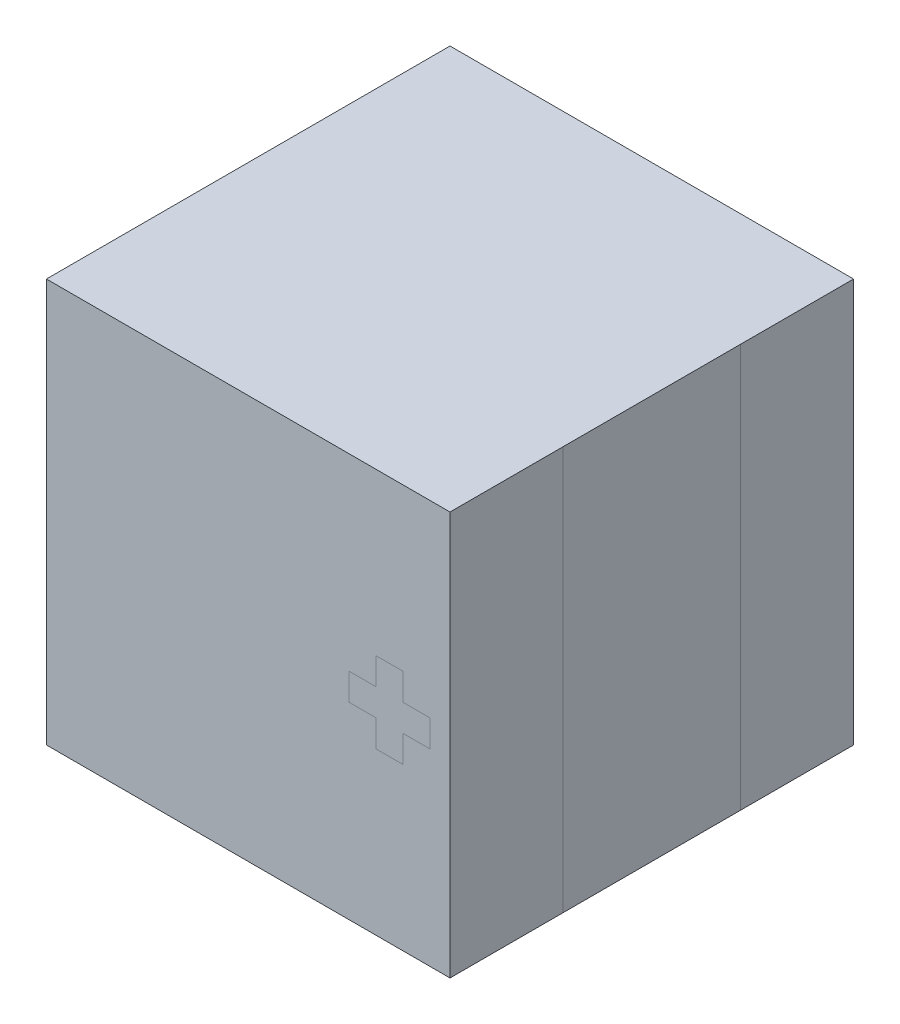
ISO-10303-21;
HEADER;
FILE_DESCRIPTION(('STEP AP214'),'2;1');
FILE_NAME('part.step','',(''),(''),'','','');
FILE_SCHEMA(('AUTOMOTIVE_DESIGN { 1 0 10303 214 1 1 1 1 }'));
ENDSEC;
DATA;
#1=APPLICATION_CONTEXT('core data for automotive mechanical design processes');
#2=APPLICATION_PROTOCOL_DEFINITION('international standard','automotive_design',2000,#1);
#3=PRODUCT_CONTEXT('',#1,'mechanical');
#4=PRODUCT('Part','Part','',(#3));
#5=PRODUCT_RELATED_PRODUCT_CATEGORY('part','',(#4));
#6=PRODUCT_DEFINITION_FORMATION('','',#4);
#7=PRODUCT_DEFINITION_CONTEXT('part definition',#1,'design');
#8=PRODUCT_DEFINITION('design','',#6,#7);
#9=PRODUCT_DEFINITION_SHAPE('','',#8);
#10=(LENGTH_UNIT() NAMED_UNIT(*) SI_UNIT(.MILLI.,.METRE.));
#11=(NAMED_UNIT(*) PLANE_ANGLE_UNIT() SI_UNIT($,.RADIAN.));
#12=(NAMED_UNIT(*) SI_UNIT($,.STERADIAN.) SOLID_ANGLE_UNIT());
#13=UNCERTAINTY_MEASURE_WITH_UNIT(LENGTH_MEASURE(1.E-05),#10,'distance_accuracy_value','');
#14=(GEOMETRIC_REPRESENTATION_CONTEXT(3) GLOBAL_UNCERTAINTY_ASSIGNED_CONTEXT((#13)) GLOBAL_UNIT_ASSIGNED_CONTEXT((#10,
#11,#12)) REPRESENTATION_CONTEXT('',''));
#15=CARTESIAN_POINT('',(0.,0.,0.));
#16=DIRECTION('',(0.,0.,1.));
#17=DIRECTION('',(1.,0.,0.));
#18=AXIS2_PLACEMENT_3D('',#15,#16,#17);
#19=CARTESIAN_POINT('',(-2.5,5.,2.5));
#20=DIRECTION('',(1.,0.,0.));
#21=DIRECTION('',(0.,0.,-1.));
#22=AXIS2_PLACEMENT_3D('',#19,#20,#21);
#23=PLANE('',#22);
#24=DIRECTION('',(0.,1.,0.));
#25=VECTOR('',#24,1.);
#26=CARTESIAN_POINT('',(-2.5,5.,1.1));
#27=LINE('',#26,#25);
#28=CARTESIAN_POINT('',(-2.5,0.,1.1));
#29=VERTEX_POINT('',#28);
#30=CARTESIAN_POINT('',(-2.5,5.,1.1));
#31=VERTEX_POINT('',#30);
#32=EDGE_CURVE('E11',#29,#31,#27,.T.);
#33=ORIENTED_EDGE('',*,*,#32,.F.);
#34=DIRECTION('',(0.,0.,1.));
#35=VECTOR('',#34,1.);
#36=CARTESIAN_POINT('',(-2.5,0.,2.5));
#37=LINE('',#36,#35);
#38=CARTESIAN_POINT('',(-2.5,0.,2.5));
#39=VERTEX_POINT('',#38);
#40=EDGE_CURVE('E235',#29,#39,#37,.T.);
#41=ORIENTED_EDGE('',*,*,#40,.T.);
#42=DIRECTION('',(0.,-1.,0.));
#43=VECTOR('',#42,1.);
#44=CARTESIAN_POINT('',(-2.5,5.,2.5));
#45=LINE('',#44,#43);
#46=CARTESIAN_POINT('',(-2.5,5.,2.5));
#47=VERTEX_POINT('',#46);
#48=EDGE_CURVE('E180',#47,#39,#45,.T.);
#49=ORIENTED_EDGE('',*,*,#48,.F.);
#50=DIRECTION('',(0.,0.,1.));
#51=VECTOR('',#50,1.);
#52=CARTESIAN_POINT('',(-2.5,5.,2.5));
#53=LINE('',#52,#51);
#54=EDGE_CURVE('E164',#31,#47,#53,.T.);
#55=ORIENTED_EDGE('',*,*,#54,.F.);
#56=EDGE_LOOP('',(#33,#41,#49,#55));
#57=FACE_BOUND('',#56,.T.);
#58=ADVANCED_FACE('F42',(#57),#23,.F.);
#59=DIRECTION('',(0.,-1.,0.));
#60=VECTOR('',#59,1.);
#61=CARTESIAN_POINT('',(-2.5,5.,-1.1));
#62=LINE('',#61,#60);
#63=CARTESIAN_POINT('',(-2.5,5.,-1.1));
#64=VERTEX_POINT('',#63);
#65=CARTESIAN_POINT('',(-2.5,0.,-1.1));
#66=VERTEX_POINT('',#65);
#67=EDGE_CURVE('E51',#64,#66,#62,.T.);
#68=ORIENTED_EDGE('',*,*,#67,.F.);
#69=CARTESIAN_POINT('',(-2.5,5.,-2.5));
#70=VERTEX_POINT('',#69);
#71=EDGE_CURVE('E259',#70,#64,#53,.T.);
#72=ORIENTED_EDGE('',*,*,#71,.F.);
#73=DIRECTION('',(0.,-1.,0.));
#74=VECTOR('',#73,1.);
#75=CARTESIAN_POINT('',(-2.5,5.,-2.5));
#76=LINE('',#75,#74);
#77=CARTESIAN_POINT('',(-2.5,0.,-2.5));
#78=VERTEX_POINT('',#77);
#79=EDGE_CURVE('E162',#70,#78,#76,.T.);
#80=ORIENTED_EDGE('',*,*,#79,.T.);
#81=EDGE_CURVE('E233',#78,#66,#37,.T.);
#82=ORIENTED_EDGE('',*,*,#81,.T.);
#83=EDGE_LOOP('',(#68,#72,#80,#82));
#84=FACE_BOUND('',#83,.T.);
#85=ADVANCED_FACE('F238',(#84),#23,.F.);
#86=CARTESIAN_POINT('',(2.5,5.,2.5));
#87=DIRECTION('',(-1.,0.,0.));
#88=DIRECTION('',(0.,0.,1.));
#89=AXIS2_PLACEMENT_3D('',#86,#87,#88);
#90=PLANE('',#89);
#91=DIRECTION('',(0.,1.,0.));
#92=VECTOR('',#91,1.);
#93=CARTESIAN_POINT('',(2.5,5.,-1.1));
#94=LINE('',#93,#92);
#95=CARTESIAN_POINT('',(2.5,0.,-1.1));
#96=VERTEX_POINT('',#95);
#97=CARTESIAN_POINT('',(2.5,5.,-1.1));
#98=VERTEX_POINT('',#97);
#99=EDGE_CURVE('E218',#96,#98,#94,.T.);
#100=ORIENTED_EDGE('',*,*,#99,.F.);
#101=DIRECTION('',(0.,0.,-1.));
#102=VECTOR('',#101,1.);
#103=CARTESIAN_POINT('',(2.5,0.,2.5));
#104=LINE('',#103,#102);
#105=CARTESIAN_POINT('',(2.5,0.,-2.5));
#106=VERTEX_POINT('',#105);
#107=EDGE_CURVE('E168',#96,#106,#104,.T.);
#108=ORIENTED_EDGE('',*,*,#107,.T.);
#109=DIRECTION('',(0.,-1.,0.));
#110=VECTOR('',#109,1.);
#111=CARTESIAN_POINT('',(2.5,5.,-2.5));
#112=LINE('',#111,#110);
#113=CARTESIAN_POINT('',(2.5,5.,-2.5));
#114=VERTEX_POINT('',#113);
#115=EDGE_CURVE('E160',#114,#106,#112,.T.);
#116=ORIENTED_EDGE('',*,*,#115,.F.);
#117=DIRECTION('',(0.,0.,-1.));
#118=VECTOR('',#117,1.);
#119=CARTESIAN_POINT('',(2.5,5.,2.5));
#120=LINE('',#119,#118);
#121=EDGE_CURVE('E142',#98,#114,#120,.T.);
#122=ORIENTED_EDGE('',*,*,#121,.F.);
#123=EDGE_LOOP('',(#100,#108,#116,#122));
#124=FACE_BOUND('',#123,.T.);
#125=ADVANCED_FACE('F166',(#124),#90,.F.);
#126=DIRECTION('',(0.,-1.,0.));
#127=VECTOR('',#126,1.);
#128=CARTESIAN_POINT('',(2.5,5.,1.1));
#129=LINE('',#128,#127);
#130=CARTESIAN_POINT('',(2.5,5.,1.1));
#131=VERTEX_POINT('',#130);
#132=CARTESIAN_POINT('',(2.5,0.,1.1));
#133=VERTEX_POINT('',#132);
#134=EDGE_CURVE('E215',#131,#133,#129,.T.);
#135=ORIENTED_EDGE('',*,*,#134,.F.);
#136=CARTESIAN_POINT('',(2.5,5.,2.5));
#137=VERTEX_POINT('',#136);
#138=EDGE_CURVE('E156',#137,#131,#120,.T.);
#139=ORIENTED_EDGE('',*,*,#138,.F.);
#140=DIRECTION('',(0.,-1.,0.));
#141=VECTOR('',#140,1.);
#142=CARTESIAN_POINT('',(2.5,5.,2.5));
#143=LINE('',#142,#141);
#144=CARTESIAN_POINT('',(2.5,0.,2.5));
#145=VERTEX_POINT('',#144);
#146=EDGE_CURVE('E258',#137,#145,#143,.T.);
#147=ORIENTED_EDGE('',*,*,#146,.T.);
#148=EDGE_CURVE('E250',#145,#133,#104,.T.);
#149=ORIENTED_EDGE('',*,*,#148,.T.);
#150=EDGE_LOOP('',(#135,#139,#147,#149));
#151=FACE_BOUND('',#150,.T.);
#152=ADVANCED_FACE('F303',(#151),#90,.F.);
#153=CARTESIAN_POINT('',(-2.5,5.,2.5));
#154=DIRECTION('',(0.,0.,-1.));
#155=DIRECTION('',(-1.,0.,0.));
#156=AXIS2_PLACEMENT_3D('',#153,#154,#155);
#157=PLANE('',#156);
#158=DIRECTION('',(1.,0.,0.));
#159=VECTOR('',#158,1.);
#160=CARTESIAN_POINT('',(-2.5,0.,2.5));
#161=LINE('',#160,#159);
#162=EDGE_CURVE('E154',#39,#145,#161,.T.);
#163=ORIENTED_EDGE('',*,*,#162,.T.);
#164=ORIENTED_EDGE('',*,*,#146,.F.);
#165=DIRECTION('',(1.,0.,0.));
#166=VECTOR('',#165,1.);
#167=CARTESIAN_POINT('',(-2.5,5.,2.5));
#168=LINE('',#167,#166);
#169=EDGE_CURVE('E255',#47,#137,#168,.T.);
#170=ORIENTED_EDGE('',*,*,#169,.F.);
#171=ORIENTED_EDGE('',*,*,#48,.T.);
#172=EDGE_LOOP('',(#163,#164,#170,#171));
#173=FACE_BOUND('',#172,.T.);
#174=DIRECTION('',(0.,-1.,0.));
#175=VECTOR('',#174,1.);
#176=CARTESIAN_POINT('',(1.25,5.,2.5));
#177=LINE('',#176,#175);
#178=CARTESIAN_POINT('',(1.25,2.66666666666667,2.5));
#179=VERTEX_POINT('',#178);
#180=CARTESIAN_POINT('',(1.25,2.33333333333333,2.5));
#181=VERTEX_POINT('',#180);
#182=EDGE_CURVE('E212',#179,#181,#177,.T.);
#183=ORIENTED_EDGE('',*,*,#182,.F.);
#184=DIRECTION('',(-1.,0.,0.));
#185=VECTOR('',#184,1.);
#186=CARTESIAN_POINT('',(-2.5,2.66666666666667,2.5));
#187=LINE('',#186,#185);
#188=CARTESIAN_POINT('',(1.58333333333333,2.66666666666667,2.5));
#189=VERTEX_POINT('',#188);
#190=EDGE_CURVE('E171',#189,#179,#187,.T.);
#191=ORIENTED_EDGE('',*,*,#190,.F.);
#192=DIRECTION('',(0.,-1.,0.));
#193=VECTOR('',#192,1.);
#194=CARTESIAN_POINT('',(1.58333333333333,5.,2.5));
#195=LINE('',#194,#193);
#196=CARTESIAN_POINT('',(1.58333333333333,3.,2.5));
#197=VERTEX_POINT('',#196);
#198=EDGE_CURVE('E177',#197,#189,#195,.T.);
#199=ORIENTED_EDGE('',*,*,#198,.F.);
#200=DIRECTION('',(-1.,0.,0.));
#201=VECTOR('',#200,1.);
#202=CARTESIAN_POINT('',(-2.5,2.99999999999999,2.5));
#203=LINE('',#202,#201);
#204=CARTESIAN_POINT('',(1.91666666666667,3.,2.5));
#205=VERTEX_POINT('',#204);
#206=EDGE_CURVE('E186',#205,#197,#203,.T.);
#207=ORIENTED_EDGE('',*,*,#206,.F.);
#208=DIRECTION('',(0.,1.,0.));
#209=VECTOR('',#208,1.);
#210=CARTESIAN_POINT('',(1.91666666666667,5.,2.5));
#211=LINE('',#210,#209);
#212=CARTESIAN_POINT('',(1.91666666666667,2.66666666666667,2.5));
#213=VERTEX_POINT('',#212);
#214=EDGE_CURVE('E189',#213,#205,#211,.T.);
#215=ORIENTED_EDGE('',*,*,#214,.F.);
#216=DIRECTION('',(-1.,0.,0.));
#217=VECTOR('',#216,1.);
#218=CARTESIAN_POINT('',(-2.5,2.66666666666667,2.5));
#219=LINE('',#218,#217);
#220=CARTESIAN_POINT('',(2.25,2.66666666666667,2.5));
#221=VERTEX_POINT('',#220);
#222=EDGE_CURVE('E192',#221,#213,#219,.T.);
#223=ORIENTED_EDGE('',*,*,#222,.F.);
#224=DIRECTION('',(0.,1.,0.));
#225=VECTOR('',#224,1.);
#226=CARTESIAN_POINT('',(2.25,5.,2.5));
#227=LINE('',#226,#225);
#228=CARTESIAN_POINT('',(2.25,2.33333333333333,2.5));
#229=VERTEX_POINT('',#228);
#230=EDGE_CURVE('E195',#229,#221,#227,.T.);
#231=ORIENTED_EDGE('',*,*,#230,.F.);
#232=DIRECTION('',(1.,0.,0.));
#233=VECTOR('',#232,1.);
#234=CARTESIAN_POINT('',(-2.49999999999999,2.33333333333332,2.5));
#235=LINE('',#234,#233);
#236=CARTESIAN_POINT('',(1.91666666666667,2.33333333333333,2.5));
#237=VERTEX_POINT('',#236);
#238=EDGE_CURVE('E197',#237,#229,#235,.T.);
#239=ORIENTED_EDGE('',*,*,#238,.F.);
#240=DIRECTION('',(0.,1.,0.));
#241=VECTOR('',#240,1.);
#242=CARTESIAN_POINT('',(1.91666666666667,5.,2.5));
#243=LINE('',#242,#241);
#244=CARTESIAN_POINT('',(1.91666666666667,2.,2.5));
#245=VERTEX_POINT('',#244);
#246=EDGE_CURVE('E200',#245,#237,#243,.T.);
#247=ORIENTED_EDGE('',*,*,#246,.F.);
#248=DIRECTION('',(1.,0.,0.));
#249=VECTOR('',#248,1.);
#250=CARTESIAN_POINT('',(-2.5,2.,2.5));
#251=LINE('',#250,#249);
#252=CARTESIAN_POINT('',(1.58333333333333,2.,2.5));
#253=VERTEX_POINT('',#252);
#254=EDGE_CURVE('E203',#253,#245,#251,.T.);
#255=ORIENTED_EDGE('',*,*,#254,.F.);
#256=DIRECTION('',(0.,-1.,0.));
#257=VECTOR('',#256,1.);
#258=CARTESIAN_POINT('',(1.58333333333333,5.,2.5));
#259=LINE('',#258,#257);
#260=CARTESIAN_POINT('',(1.58333333333333,2.33333333333333,2.5));
#261=VERTEX_POINT('',#260);
#262=EDGE_CURVE('E206',#261,#253,#259,.T.);
#263=ORIENTED_EDGE('',*,*,#262,.F.);
#264=DIRECTION('',(1.,0.,0.));
#265=VECTOR('',#264,1.);
#266=CARTESIAN_POINT('',(-2.50000000000002,2.33333333333335,2.5));
#267=LINE('',#266,#265);
#268=EDGE_CURVE('E209',#181,#261,#267,.T.);
#269=ORIENTED_EDGE('',*,*,#268,.F.);
#270=EDGE_LOOP('',(#183,#191,#199,#207,#215,#223,#231,#239,#247,#255,#263,#269));
#271=FACE_BOUND('',#270,.T.);
#272=ADVANCED_FACE('F299',(#173,#271),#157,.F.);
#273=EDGE_CURVE('E252',#133,#96,#104,.T.);
#274=ORIENTED_EDGE('',*,*,#273,.T.);
#275=ORIENTED_EDGE('',*,*,#99,.T.);
#276=EDGE_CURVE('E150',#131,#98,#120,.T.);
#277=ORIENTED_EDGE('',*,*,#276,.F.);
#278=ORIENTED_EDGE('',*,*,#134,.T.);
#279=EDGE_LOOP('',(#274,#275,#277,#278));
#280=FACE_BOUND('',#279,.T.);
#281=ADVANCED_FACE('F44',(#280),#90,.F.);
#282=CARTESIAN_POINT('',(-2.5,5.,-2.5));
#283=DIRECTION('',(0.,0.,1.));
#284=DIRECTION('',(1.,0.,0.));
#285=AXIS2_PLACEMENT_3D('',#282,#283,#284);
#286=PLANE('',#285);
#287=DIRECTION('',(-1.,0.,0.));
#288=VECTOR('',#287,1.);
#289=CARTESIAN_POINT('',(-2.5,0.,-2.5));
#290=LINE('',#289,#288);
#291=EDGE_CURVE('E245',#106,#78,#290,.T.);
#292=ORIENTED_EDGE('',*,*,#291,.T.);
#293=ORIENTED_EDGE('',*,*,#79,.F.);
#294=DIRECTION('',(-1.,0.,0.));
#295=VECTOR('',#294,1.);
#296=CARTESIAN_POINT('',(-2.5,5.,-2.5));
#297=LINE('',#296,#295);
#298=EDGE_CURVE('E147',#114,#70,#297,.T.);
#299=ORIENTED_EDGE('',*,*,#298,.F.);
#300=ORIENTED_EDGE('',*,*,#115,.T.);
#301=EDGE_LOOP('',(#292,#293,#299,#300));
#302=FACE_BOUND('',#301,.T.);
#303=ADVANCED_FACE('F159',(#302),#286,.F.);
#304=EDGE_CURVE('E225',#66,#29,#37,.T.);
#305=ORIENTED_EDGE('',*,*,#304,.T.);
#306=ORIENTED_EDGE('',*,*,#32,.T.);
#307=EDGE_CURVE('E227',#64,#31,#53,.T.);
#308=ORIENTED_EDGE('',*,*,#307,.F.);
#309=ORIENTED_EDGE('',*,*,#67,.T.);
#310=EDGE_LOOP('',(#305,#306,#308,#309));
#311=FACE_BOUND('',#310,.T.);
#312=ADVANCED_FACE('F224',(#311),#23,.F.);
#313=ORIENTED_EDGE('',*,*,#190,.T.);
#314=ORIENTED_EDGE('',*,*,#182,.T.);
#315=ORIENTED_EDGE('',*,*,#268,.T.);
#316=ORIENTED_EDGE('',*,*,#262,.T.);
#317=ORIENTED_EDGE('',*,*,#254,.T.);
#318=ORIENTED_EDGE('',*,*,#246,.T.);
#319=ORIENTED_EDGE('',*,*,#238,.T.);
#320=ORIENTED_EDGE('',*,*,#230,.T.);
#321=ORIENTED_EDGE('',*,*,#222,.T.);
#322=ORIENTED_EDGE('',*,*,#214,.T.);
#323=ORIENTED_EDGE('',*,*,#206,.T.);
#324=ORIENTED_EDGE('',*,*,#198,.T.);
#325=EDGE_LOOP('',(#313,#314,#315,#316,#317,#318,#319,#320,#321,#322,#323,#324));
#326=FACE_BOUND('',#325,.T.);
#327=ADVANCED_FACE('F333',(#326),#157,.F.);
#328=CARTESIAN_POINT('',(0.,5.,0.));
#329=DIRECTION('',(0.,-1.,0.));
#330=DIRECTION('',(0.,0.,-1.));
#331=AXIS2_PLACEMENT_3D('',#328,#329,#330);
#332=PLANE('',#331);
#333=ORIENTED_EDGE('',*,*,#138,.T.);
#334=ORIENTED_EDGE('',*,*,#276,.T.);
#335=ORIENTED_EDGE('',*,*,#121,.T.);
#336=ORIENTED_EDGE('',*,*,#298,.T.);
#337=ORIENTED_EDGE('',*,*,#71,.T.);
#338=ORIENTED_EDGE('',*,*,#307,.T.);
#339=ORIENTED_EDGE('',*,*,#54,.T.);
#340=ORIENTED_EDGE('',*,*,#169,.T.);
#341=EDGE_LOOP('',(#333,#334,#335,#336,#337,#338,#339,#340));
#342=FACE_BOUND('',#341,.T.);
#343=ADVANCED_FACE('F145',(#342),#332,.F.);
#344=CARTESIAN_POINT('',(0.,0.,0.));
#345=DIRECTION('',(0.,-1.,0.));
#346=DIRECTION('',(0.,0.,-1.));
#347=AXIS2_PLACEMENT_3D('',#344,#345,#346);
#348=PLANE('',#347);
#349=ORIENTED_EDGE('',*,*,#148,.F.);
#350=ORIENTED_EDGE('',*,*,#162,.F.);
#351=ORIENTED_EDGE('',*,*,#40,.F.);
#352=ORIENTED_EDGE('',*,*,#304,.F.);
#353=ORIENTED_EDGE('',*,*,#81,.F.);
#354=ORIENTED_EDGE('',*,*,#291,.F.);
#355=ORIENTED_EDGE('',*,*,#107,.F.);
#356=ORIENTED_EDGE('',*,*,#273,.F.);
#357=EDGE_LOOP('',(#349,#350,#351,#352,#353,#354,#355,#356));
#358=FACE_BOUND('',#357,.T.);
#359=ADVANCED_FACE('F232',(#358),#348,.T.);
#360=CLOSED_SHELL('',(#58,#85,#125,#152,#272,#281,#303,#312,#327,#343,#359));
#361=MANIFOLD_SOLID_BREP('B2',#360);
#362=ADVANCED_BREP_SHAPE_REPRESENTATION('',(#18,#361),#14);
#363=SHAPE_DEFINITION_REPRESENTATION(#9,#362);
ENDSEC;
END-ISO-10303-21;
